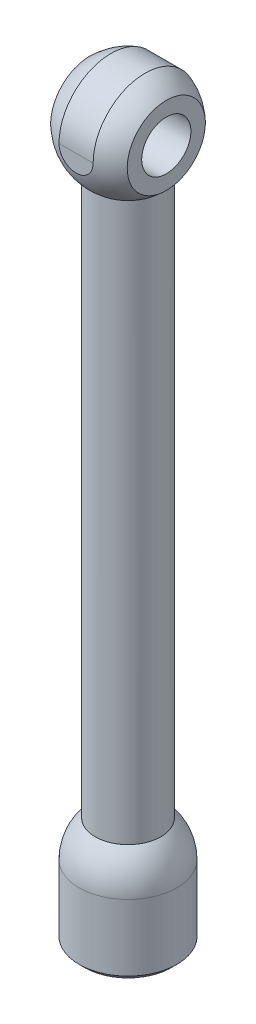
ISO-10303-21;
HEADER;
FILE_DESCRIPTION(('STEP AP214'),'2;1');
FILE_NAME('part.step','',(''),(''),'','','');
FILE_SCHEMA(('AUTOMOTIVE_DESIGN { 1 0 10303 214 1 1 1 1 }'));
ENDSEC;
DATA;
#1=APPLICATION_CONTEXT('core data for automotive mechanical design processes');
#2=APPLICATION_PROTOCOL_DEFINITION('international standard','automotive_design',2000,#1);
#3=PRODUCT_CONTEXT('',#1,'mechanical');
#4=PRODUCT('Part','Part','',(#3));
#5=PRODUCT_RELATED_PRODUCT_CATEGORY('part','',(#4));
#6=PRODUCT_DEFINITION_FORMATION('','',#4);
#7=PRODUCT_DEFINITION_CONTEXT('part definition',#1,'design');
#8=PRODUCT_DEFINITION('design','',#6,#7);
#9=PRODUCT_DEFINITION_SHAPE('','',#8);
#10=(LENGTH_UNIT() NAMED_UNIT(*) SI_UNIT(.MILLI.,.METRE.));
#11=(NAMED_UNIT(*) PLANE_ANGLE_UNIT() SI_UNIT($,.RADIAN.));
#12=(NAMED_UNIT(*) SI_UNIT($,.STERADIAN.) SOLID_ANGLE_UNIT());
#13=UNCERTAINTY_MEASURE_WITH_UNIT(LENGTH_MEASURE(1.E-05),#10,'distance_accuracy_value','');
#14=(GEOMETRIC_REPRESENTATION_CONTEXT(3) GLOBAL_UNCERTAINTY_ASSIGNED_CONTEXT((#13)) GLOBAL_UNIT_ASSIGNED_CONTEXT((#10,
#11,#12)) REPRESENTATION_CONTEXT('',''));
#15=CARTESIAN_POINT('',(0.,0.,0.));
#16=DIRECTION('',(0.,0.,1.));
#17=DIRECTION('',(1.,0.,0.));
#18=AXIS2_PLACEMENT_3D('',#15,#16,#17);
#19=CARTESIAN_POINT('',(0.,-110.,0.));
#20=DIRECTION('',(0.,1.,0.));
#21=DIRECTION('',(0.,0.,1.));
#22=AXIS2_PLACEMENT_3D('',#19,#20,#21);
#23=PLANE('',#22);
#24=CARTESIAN_POINT('',(0.,-110.,0.));
#25=DIRECTION('',(0.,1.,0.));
#26=DIRECTION('',(0.,0.,1.));
#27=AXIS2_PLACEMENT_3D('',#24,#25,#26);
#28=CIRCLE('',#27,5.99999999999993);
#29=CARTESIAN_POINT('',(0.,-110.,5.99999999999993));
#30=VERTEX_POINT('',#29);
#31=EDGE_CURVE('E187',#30,#30,#28,.T.);
#32=ORIENTED_EDGE('',*,*,#31,.T.);
#33=EDGE_LOOP('',(#32));
#34=FACE_BOUND('',#33,.T.);
#35=ADVANCED_FACE('F45',(#34),#23,.T.);
#36=CARTESIAN_POINT('',(0.,-116.617750984857,0.));
#37=DIRECTION('',(0.,1.,0.));
#38=DIRECTION('',(-1.,0.,0.));
#39=AXIS2_PLACEMENT_3D('',#36,#37,#38);
#40=SPHERICAL_SURFACE('',#39,8.93278389403744);
#41=CARTESIAN_POINT('',(0.,-116.617750984857,0.));
#42=DIRECTION('',(0.,1.,0.));
#43=DIRECTION('',(0.,0.,1.));
#44=AXIS2_PLACEMENT_3D('',#41,#42,#43);
#45=CIRCLE('',#44,8.93278389403744);
#46=CARTESIAN_POINT('',(0.,-116.617750984857,8.93278389403744));
#47=VERTEX_POINT('',#46);
#48=EDGE_CURVE('E112',#47,#47,#45,.T.);
#49=ORIENTED_EDGE('',*,*,#48,.T.);
#50=EDGE_LOOP('',(#49));
#51=FACE_BOUND('',#50,.T.);
#52=ORIENTED_EDGE('',*,*,#31,.F.);
#53=EDGE_LOOP('',(#52));
#54=FACE_BOUND('',#53,.T.);
#55=ADVANCED_FACE('F208',(#51,#54),#40,.T.);
#56=CARTESIAN_POINT('',(0.,-110.,0.));
#57=DIRECTION('',(0.,1.,0.));
#58=DIRECTION('',(0.,0.,1.));
#59=AXIS2_PLACEMENT_3D('',#56,#57,#58);
#60=CYLINDRICAL_SURFACE('',#59,8.93278389403744);
#61=DIRECTION('',(0.,1.,0.));
#62=VECTOR('',#61,1.);
#63=CARTESIAN_POINT('',(-7.71651657793688,-110.,4.5));
#64=LINE('',#63,#62);
#65=CARTESIAN_POINT('',(-7.71651657793688,-124.74705533382,4.5));
#66=VERTEX_POINT('',#65);
#67=CARTESIAN_POINT('',(-7.71651657793688,-128.752400890706,4.5));
#68=VERTEX_POINT('',#67);
#69=EDGE_CURVE('E101',#66,#68,#64,.F.);
#70=ORIENTED_EDGE('',*,*,#69,.T.);
#71=CARTESIAN_POINT('',(0.,-128.752400890706,0.));
#72=DIRECTION('',(0.,-1.,0.));
#73=DIRECTION('',(0.,0.,-1.));
#74=AXIS2_PLACEMENT_3D('',#71,#72,#73);
#75=CIRCLE('',#74,8.93278389403744);
#76=CARTESIAN_POINT('',(-7.71651657793688,-128.752400890706,-4.5));
#77=VERTEX_POINT('',#76);
#78=EDGE_CURVE('E12',#68,#77,#75,.F.);
#79=ORIENTED_EDGE('',*,*,#78,.T.);
#80=DIRECTION('',(0.,1.,0.));
#81=VECTOR('',#80,1.);
#82=CARTESIAN_POINT('',(-7.71651657793688,-110.,-4.5));
#83=LINE('',#82,#81);
#84=CARTESIAN_POINT('',(-7.71651657793688,-124.74705533382,-4.5));
#85=VERTEX_POINT('',#84);
#86=EDGE_CURVE('E124',#77,#85,#83,.T.);
#87=ORIENTED_EDGE('',*,*,#86,.T.);
#88=CARTESIAN_POINT('',(-7.71651657793688,-124.74705533382,-4.5));
#89=CARTESIAN_POINT('',(-7.71648148458441,-124.62934163974,-4.50002139169564));
#90=CARTESIAN_POINT('',(-7.71920922138473,-124.511647458003,-4.49538191249904));
#91=CARTESIAN_POINT('',(-7.72992604435372,-124.27729071066,-4.47694954682138));
#92=CARTESIAN_POINT('',(-7.73791184101997,-124.160627546253,-4.46316238319492));
#93=CARTESIAN_POINT('',(-7.75882019135261,-123.929848084622,-4.42670876454432));
#94=CARTESIAN_POINT('',(-7.77171380436301,-123.815720930911,-4.40409434298652));
#95=CARTESIAN_POINT('',(-7.80196055423327,-123.590131942456,-4.35028623981661));
#96=CARTESIAN_POINT('',(-7.8193142146088,-123.478670422281,-4.31909155103154));
#97=CARTESIAN_POINT('',(-7.87714055924617,-123.149851300292,-4.21328612874883));
#98=CARTESIAN_POINT('',(-7.92344856967786,-122.93735023567,-4.12633959385483));
#99=CARTESIAN_POINT('',(-8.02631514591867,-122.529794960636,-3.92248327705004));
#100=CARTESIAN_POINT('',(-8.08288980700447,-122.334768873643,-3.80552632618143));
#101=CARTESIAN_POINT('',(-8.2056119892703,-121.950024242758,-3.53364001496265));
#102=CARTESIAN_POINT('',(-8.27216433247432,-121.762093506634,-3.37636281785361));
#103=CARTESIAN_POINT('',(-8.40409696069733,-121.413854583979,-3.03306942083345));
#104=CARTESIAN_POINT('',(-8.46947691977481,-121.253553975573,-2.84704536295975));
#105=CARTESIAN_POINT('',(-8.5640678533697,-121.031750751577,-2.54239824040522));
#106=CARTESIAN_POINT('',(-8.59596139894984,-120.958966486761,-2.43265344393515));
#107=CARTESIAN_POINT('',(-8.65674343891858,-120.822990666671,-2.20660168902057));
#108=CARTESIAN_POINT('',(-8.68563312471219,-120.759795303599,-2.09029736069746));
#109=CARTESIAN_POINT('',(-8.73957218506538,-120.643625178834,-1.85187619331278));
#110=CARTESIAN_POINT('',(-8.7646225424196,-120.590647800632,-1.72976085228336));
#111=CARTESIAN_POINT('',(-8.81014151531057,-120.495501205936,-1.4805632291025));
#112=CARTESIAN_POINT('',(-8.83061062647131,-120.453330820211,-1.35348148599226));
#113=CARTESIAN_POINT('',(-8.86503972481586,-120.382977906547,-1.10468011841556));
#114=CARTESIAN_POINT('',(-8.87936231228362,-120.354006741381,-0.983233413837728));
#115=CARTESIAN_POINT('',(-8.90310764967808,-120.306207529012,-0.73789250936364));
#116=CARTESIAN_POINT('',(-8.91253088501938,-120.287378476948,-0.613998553197462));
#117=CARTESIAN_POINT('',(-8.9262015355395,-120.260120431229,-0.364846700502499));
#118=CARTESIAN_POINT('',(-8.93045140733797,-120.251686501328,-0.239589479865255));
#119=CARTESIAN_POINT('',(-8.93365719614512,-120.24532108773,0.0112559656988013));
#120=CARTESIAN_POINT('',(-8.93261344344934,-120.247388948773,0.136844169485232));
#121=CARTESIAN_POINT('',(-8.92559100844603,-120.261347231178,0.376154776428594));
#122=CARTESIAN_POINT('',(-8.92005745723589,-120.272351732289,0.489943229521901));
#123=CARTESIAN_POINT('',(-8.90475531924136,-120.302934005684,0.716108956630355));
#124=CARTESIAN_POINT('',(-8.89498539712806,-120.322514481184,0.828485774187991));
#125=CARTESIAN_POINT('',(-8.87144580035836,-120.370030126844,1.05099152130507));
#126=CARTESIAN_POINT('',(-8.85767754067973,-120.397962341498,1.16112123136584));
#127=CARTESIAN_POINT('',(-8.82646410037359,-120.461893686399,1.37849425748619));
#128=CARTESIAN_POINT('',(-8.80901751122325,-120.497895907184,1.48573645005318));
#129=CARTESIAN_POINT('',(-8.75121546963237,-120.618588299403,1.80495704439684));
#130=CARTESIAN_POINT('',(-8.70571167465526,-120.715352106389,2.0115881184797));
#131=CARTESIAN_POINT('',(-8.60506056587032,-120.937564574719,2.40606702370569));
#132=CARTESIAN_POINT('',(-8.54990968130288,-121.063023862673,2.59390785924891));
#133=CARTESIAN_POINT('',(-8.4289065437931,-121.352821628363,2.9647450055318));
#134=CARTESIAN_POINT('',(-8.36253530114493,-121.519728749244,3.14556578013506));
#135=CARTESIAN_POINT('',(-8.22987252265295,-121.880985090627,3.47791631653475));
#136=CARTESIAN_POINT('',(-8.16358111596308,-122.075359369112,3.62941902938453));
#137=CARTESIAN_POINT('',(-8.06739890835108,-122.391367765796,3.8364085613677));
#138=CARTESIAN_POINT('',(-8.03495188459116,-122.504642791429,3.90371968519037));
#139=CARTESIAN_POINT('',(-7.97315285074131,-122.737303152918,4.02843608612254));
#140=CARTESIAN_POINT('',(-7.94379948216436,-122.856685772309,4.08584571828684));
#141=CARTESIAN_POINT('',(-7.88930878866345,-123.100645962726,4.1900950050093));
#142=CARTESIAN_POINT('',(-7.86416376235475,-123.225213511533,4.23695402300319));
#143=CARTESIAN_POINT('',(-7.81904912381102,-123.478797869829,4.31964261153951));
#144=CARTESIAN_POINT('',(-7.79907727479617,-123.607812728957,4.3554769501984));
#145=CARTESIAN_POINT('',(-7.76086423474424,-123.902784737641,4.42329445694898));
#146=CARTESIAN_POINT('',(-7.74436712306624,-124.069763061552,4.45195785045429));
#147=CARTESIAN_POINT('',(-7.72773047351135,-124.322423955871,4.48072723691847));
#148=CARTESIAN_POINT('',(-7.72353629190816,-124.407104876786,4.48794616418604));
#149=CARTESIAN_POINT('',(-7.71792590682583,-124.576866156951,4.49758429057258));
#150=CARTESIAN_POINT('',(-7.71651086206458,-124.661946667989,4.50000148768965));
#151=CARTESIAN_POINT('',(-7.71651657793688,-124.74705533382,4.5));
#152=B_SPLINE_CURVE_WITH_KNOTS('',3,(#88,#89,#90,#91,#92,#93,#94,#95,#96,#97,#98,#99,#100,#101,
#102,#103,#104,#105,#106,#107,#108,#109,#110,#111,#112,#113,#114,#115,#116,#117,#118,#119,#120,
#121,#122,#123,#124,#125,#126,#127,#128,#129,#130,#131,#132,#133,#134,#135,#136,#137,#138,#139,
#140,#141,#142,#143,#144,#145,#146,#147,#148,#149,#150,#151),.UNSPECIFIED.,.F.,.F.,(4,2,2,2,2,2,
2,2,2,2,2,2,2,2,2,2,2,2,2,2,2,2,2,2,2,2,2,2,2,2,2,4),(0.,0.352986131275732,0.705751639946816,
1.0564683856131,1.40722631685948,2.10660502931816,2.80708979857007,3.56578442206685,
4.32468680300397,4.73072345067371,5.13659843488338,5.54236934870849,5.94809634280057,
6.32460470108411,6.70107574882384,7.07736795597132,7.45363668466587,7.7965898373916,
8.13965116963131,8.48259124301529,8.82566287587469,9.52047414968345,10.2155431462219,
10.9769866000108,11.7391292494854,12.1457870271982,12.5522654825785,12.9579917384768,
13.3635422724,13.8726473796493,14.12776595188,14.38299086927),.UNSPECIFIED.);
#153=EDGE_CURVE('E119',#85,#66,#152,.T.);
#154=ORIENTED_EDGE('',*,*,#153,.T.);
#155=EDGE_LOOP('',(#70,#79,#87,#154));
#156=FACE_BOUND('',#155,.T.);
#157=ORIENTED_EDGE('',*,*,#48,.F.);
#158=EDGE_LOOP('',(#157));
#159=FACE_BOUND('',#158,.T.);
#160=ADVANCED_FACE('F126',(#156,#159),#60,.T.);
#161=CARTESIAN_POINT('',(0.,-129.752400890706,0.));
#162=DIRECTION('',(0.,-1.,0.));
#163=DIRECTION('',(0.,0.,-1.));
#164=AXIS2_PLACEMENT_3D('',#161,#162,#163);
#165=PLANE('',#164);
#166=DIRECTION('',(1.,0.,0.));
#167=VECTOR('',#166,1.);
#168=CARTESIAN_POINT('',(-8.93378389403744,-129.752400890706,4.5));
#169=LINE('',#168,#167);
#170=CARTESIAN_POINT('',(-6.53292126919495,-129.752400890706,4.5));
#171=VERTEX_POINT('',#170);
#172=CARTESIAN_POINT('',(-3.98341815305991,-129.752400890706,4.5));
#173=VERTEX_POINT('',#172);
#174=EDGE_CURVE('E123',#171,#173,#169,.T.);
#175=ORIENTED_EDGE('',*,*,#174,.T.);
#176=CARTESIAN_POINT('',(0.,-129.752400890706,0.));
#177=DIRECTION('',(0.,-1.,0.));
#178=DIRECTION('',(0.,0.,-1.));
#179=AXIS2_PLACEMENT_3D('',#176,#177,#178);
#180=CIRCLE('',#179,6.00979368881555);
#181=CARTESIAN_POINT('',(-3.98341815305991,-129.752400890706,-4.5));
#182=VERTEX_POINT('',#181);
#183=EDGE_CURVE('E68',#173,#182,#180,.F.);
#184=ORIENTED_EDGE('',*,*,#183,.T.);
#185=DIRECTION('',(1.,0.,0.));
#186=VECTOR('',#185,1.);
#187=CARTESIAN_POINT('',(-8.93378389403744,-129.752400890706,-4.5));
#188=LINE('',#187,#186);
#189=CARTESIAN_POINT('',(-6.53292126919495,-129.752400890706,-4.5));
#190=VERTEX_POINT('',#189);
#191=EDGE_CURVE('E180',#190,#182,#188,.T.);
#192=ORIENTED_EDGE('',*,*,#191,.F.);
#193=CARTESIAN_POINT('',(0.,-129.752400890706,0.));
#194=DIRECTION('',(0.,-1.,0.));
#195=DIRECTION('',(0.,0.,-1.));
#196=AXIS2_PLACEMENT_3D('',#193,#194,#195);
#197=CIRCLE('',#196,7.93278389403743);
#198=EDGE_CURVE('E175',#190,#171,#197,.T.);
#199=ORIENTED_EDGE('',*,*,#198,.T.);
#200=EDGE_LOOP('',(#175,#184,#192,#199));
#201=FACE_BOUND('',#200,.T.);
#202=ADVANCED_FACE('F182',(#201),#165,.T.);
#203=CARTESIAN_POINT('',(0.,-124.863437074568,0.));
#204=DIRECTION('',(0.,-1.,0.));
#205=DIRECTION('',(0.,0.,1.));
#206=AXIS2_PLACEMENT_3D('',#203,#204,#205);
#207=SPHERICAL_SURFACE('',#206,7.00000000000001);
#208=CARTESIAN_POINT('',(0.,-124.863437074568,-4.5));
#209=DIRECTION('',(0.,0.,-1.));
#210=DIRECTION('',(0.,1.,0.));
#211=AXIS2_PLACEMENT_3D('',#208,#209,#210);
#212=CIRCLE('',#211,5.36190264738181);
#213=CARTESIAN_POINT('',(-3.1244441771975,-129.220941932118,-4.5));
#214=VERTEX_POINT('',#213);
#215=CARTESIAN_POINT('',(-5.36063944790364,-124.74705533382,-4.5));
#216=VERTEX_POINT('',#215);
#217=EDGE_CURVE('E129',#214,#216,#212,.T.);
#218=ORIENTED_EDGE('',*,*,#217,.F.);
#219=CARTESIAN_POINT('',(0.,-129.220941932118,0.));
#220=DIRECTION('',(0.,1.,0.));
#221=DIRECTION('',(0.,0.,1.));
#222=AXIS2_PLACEMENT_3D('',#219,#220,#221);
#223=CIRCLE('',#222,5.4783347302282);
#224=CARTESIAN_POINT('',(-3.12444417719767,-129.220941932118,4.5));
#225=VERTEX_POINT('',#224);
#226=EDGE_CURVE('E185',#214,#225,#223,.F.);
#227=ORIENTED_EDGE('',*,*,#226,.T.);
#228=CARTESIAN_POINT('',(0.,-124.863437074568,4.5));
#229=DIRECTION('',(0.,0.,1.));
#230=DIRECTION('',(0.,-1.,0.));
#231=AXIS2_PLACEMENT_3D('',#228,#229,#230);
#232=CIRCLE('',#231,5.36190264738181);
#233=CARTESIAN_POINT('',(-5.36063944790364,-124.74705533382,4.5));
#234=VERTEX_POINT('',#233);
#235=EDGE_CURVE('E113',#234,#225,#232,.T.);
#236=ORIENTED_EDGE('',*,*,#235,.F.);
#237=CARTESIAN_POINT('',(-5.36064378998614,-124.74725533382,-4.49999999555556));
#238=CARTESIAN_POINT('',(-5.35789557254402,-124.620669040771,-4.50001921414418));
#239=CARTESIAN_POINT('',(-5.35514523702304,-124.494084503417,-4.49467045469406));
#240=CARTESIAN_POINT('',(-5.34966003951603,-124.241820514155,-4.4733351315755));
#241=CARTESIAN_POINT('',(-5.34692517680203,-124.11614101959,-4.45734907263598));
#242=CARTESIAN_POINT('',(-5.34149226173711,-123.866663371228,-4.41485208227213));
#243=CARTESIAN_POINT('',(-5.33879418508709,-123.742863968697,-4.3883484851452));
#244=CARTESIAN_POINT('',(-5.33345230121074,-123.497937687846,-4.32500899062546));
#245=CARTESIAN_POINT('',(-5.33080849332109,-123.376810776858,-4.28817321960229));
#246=CARTESIAN_POINT('',(-5.32559342976875,-123.138054163865,-4.20441736868904));
#247=CARTESIAN_POINT('',(-5.32302219526273,-123.020425481142,-4.15749438182119));
#248=CARTESIAN_POINT('',(-5.31797077977244,-122.789495430664,-4.05388466466387));
#249=CARTESIAN_POINT('',(-5.31549063278053,-122.676195677772,-3.99719433338867));
#250=CARTESIAN_POINT('',(-5.3106418468329,-122.454838629385,-3.87449955532795));
#251=CARTESIAN_POINT('',(-5.30827314541191,-122.346778396074,-3.80850041111117));
#252=CARTESIAN_POINT('',(-5.30366221316769,-122.136561051755,-3.66760631531108));
#253=CARTESIAN_POINT('',(-5.30142002933803,-122.034406133871,-3.59270808992683));
#254=CARTESIAN_POINT('',(-5.29708052583192,-121.836814020759,-3.43460308020641));
#255=CARTESIAN_POINT('',(-5.29498314169885,-121.741373836146,-3.35140003357648));
#256=CARTESIAN_POINT('',(-5.29094684498964,-121.557805690931,-3.17721606524854));
#257=CARTESIAN_POINT('',(-5.28900799122243,-121.469680443719,-3.0862322825607));
#258=CARTESIAN_POINT('',(-5.28530437462339,-121.301427247652,-2.89718070517585));
#259=CARTESIAN_POINT('',(-5.28353957405523,-121.221297565241,-2.79911445404571));
#260=CARTESIAN_POINT('',(-5.28019606992001,-121.069555990193,-2.5965399990878));
#261=CARTESIAN_POINT('',(-5.27861743530639,-120.997947253515,-2.49202943005885));
#262=CARTESIAN_POINT('',(-5.27565973302168,-120.863835110361,-2.277411278265));
#263=CARTESIAN_POINT('',(-5.27428053834661,-120.8013259091,-2.16730731830075));
#264=CARTESIAN_POINT('',(-5.27173033657038,-120.685781759042,-1.94218206220167));
#265=CARTESIAN_POINT('',(-5.27055940649925,-120.63275031571,-1.82715896607618));
#266=CARTESIAN_POINT('',(-5.26843559301157,-120.53658892069,-1.59310134882435));
#267=CARTESIAN_POINT('',(-5.26748261526626,-120.493454685508,-1.47406858875079));
#268=CARTESIAN_POINT('',(-5.2658008749629,-120.417350620606,-1.23275040702563));
#269=CARTESIAN_POINT('',(-5.26507219503602,-120.384384536816,-1.11046380464199));
#270=CARTESIAN_POINT('',(-5.26384539961057,-120.328891137792,-0.863602264125843));
#271=CARTESIAN_POINT('',(-5.26334715645701,-120.30635804299,-0.739028632802648));
#272=CARTESIAN_POINT('',(-5.26258403408961,-120.271848574027,-0.48843011895206));
#273=CARTESIAN_POINT('',(-5.26231923607914,-120.259875873274,-0.36240474687038));
#274=CARTESIAN_POINT('',(-5.26187983156348,-120.240007579437,0.0165194931722907));
#275=CARTESIAN_POINT('',(-5.26205892566189,-120.248103519074,0.270526489642968));
#276=CARTESIAN_POINT('',(-5.26303098380243,-120.292060095259,0.647403226155348));
#277=CARTESIAN_POINT('',(-5.26347261393976,-120.312031338801,0.772397837751783));
#278=CARTESIAN_POINT('',(-5.2645866932939,-120.362421794686,1.02026526708328));
#279=CARTESIAN_POINT('',(-5.26525906221857,-120.392837372625,1.14313880730473));
#280=CARTESIAN_POINT('',(-5.26683001017105,-120.463919712209,1.38591696440232));
#281=CARTESIAN_POINT('',(-5.26772866931419,-120.504590104453,1.50582051324063));
#282=CARTESIAN_POINT('',(-5.269744934978,-120.595868825706,1.74173403056422));
#283=CARTESIAN_POINT('',(-5.27086246086828,-120.646473494949,1.85774541454135));
#284=CARTESIAN_POINT('',(-5.27330886250713,-120.757295335555,2.08514298896761));
#285=CARTESIAN_POINT('',(-5.27463783199084,-120.817516770173,2.19652710035119));
#286=CARTESIAN_POINT('',(-5.27749630550255,-120.947103248616,2.4137846365872));
#287=CARTESIAN_POINT('',(-5.2790257353922,-121.016464912065,2.51966007864342));
#288=CARTESIAN_POINT('',(-5.28227464503945,-121.163879407626,2.72522522127519));
#289=CARTESIAN_POINT('',(-5.28399418550857,-121.241935016196,2.82491292984562));
#290=CARTESIAN_POINT('',(-5.28760947728229,-121.40613361069,3.01732194889758));
#291=CARTESIAN_POINT('',(-5.28950516336978,-121.492273603526,3.11004581489799));
#292=CARTESIAN_POINT('',(-5.29346009421793,-121.672090878307,3.28794709116744));
#293=CARTESIAN_POINT('',(-5.29551940735427,-121.765771311431,3.37312131484185));
#294=CARTESIAN_POINT('',(-5.29978491984328,-121.959935825538,3.5352446793339));
#295=CARTESIAN_POINT('',(-5.30199106477898,-122.060417386205,3.61219684006504));
#296=CARTESIAN_POINT('',(-5.30653628800708,-122.26757239047,3.7574161041452));
#297=CARTESIAN_POINT('',(-5.30887545673297,-122.374250047436,3.82567719442294));
#298=CARTESIAN_POINT('',(-5.31366733162526,-122.592935135945,3.95294386988895));
#299=CARTESIAN_POINT('',(-5.31611999560211,-122.704940587413,4.011952859127));
#300=CARTESIAN_POINT('',(-5.32112483622071,-122.93366074942,4.1203929171046));
#301=CARTESIAN_POINT('',(-5.32367713034864,-123.050381025801,4.16981224088323));
#302=CARTESIAN_POINT('',(-5.32885891220375,-123.287527870843,4.25861527458581));
#303=CARTESIAN_POINT('',(-5.33148837056754,-123.407953030504,4.29800274810251));
#304=CARTESIAN_POINT('',(-5.33680336433916,-123.65155618391,4.36644852011198));
#305=CARTESIAN_POINT('',(-5.33948883488928,-123.774731004248,4.39551813160043));
#306=CARTESIAN_POINT('',(-5.34489836779516,-124.023041257913,4.44317159154655));
#307=CARTESIAN_POINT('',(-5.34762241055118,-124.148175698695,4.4617605824563));
#308=CARTESIAN_POINT('',(-5.35206750355206,-124.35252754255,4.48337051437796));
#309=CARTESIAN_POINT('',(-5.35378272514306,-124.431418316029,4.48961362302611));
#310=CARTESIAN_POINT('',(-5.35721344350307,-124.589288462428,4.49792712909222));
#311=CARTESIAN_POINT('',(-5.35892893512359,-124.668267472923,4.50000441178848));
#312=CARTESIAN_POINT('',(-5.36064378998614,-124.74725533382,4.49999999555556));
#313=B_SPLINE_CURVE_WITH_KNOTS('',3,(#237,#238,#239,#240,#241,#242,#243,#244,#245,#246,#247,
#248,#249,#250,#251,#252,#253,#254,#255,#256,#257,#258,#259,#260,#261,#262,#263,#264,#265,#266,
#267,#268,#269,#270,#271,#272,#273,#274,#275,#276,#277,#278,#279,#280,#281,#282,#283,#284,#285,
#286,#287,#288,#289,#290,#291,#292,#293,#294,#295,#296,#297,#298,#299,#300,#301,#302,#303,#304,
#305,#306,#307,#308,#309,#310,#311,#312),.UNSPECIFIED.,.F.,.F.,(4,2,2,2,2,2,2,2,2,2,2,2,2,2,2,2,
2,2,2,2,2,2,2,2,2,2,2,2,2,2,2,2,2,2,2,2,2,4),(0.,0.379732457501794,0.759446898374259,
1.13889701327351,1.51834248743767,1.89789745879229,2.27759266357387,2.65707245000288,
3.03669227453305,3.41614200946401,3.79573187360895,4.1752392574123,4.55488676722974,
4.93429144147399,5.3138361541308,5.69321628941196,6.07273602129808,6.45204525819319,
6.83148638497063,7.58957884919336,7.96898323804571,8.34825573597238,8.72766270001741,
9.10693015276056,9.48636620957604,9.86566232951207,10.2450799289058,10.6243576062366,
11.003794616343,11.3830917789727,11.762649955304,12.1420681545417,12.5219481538938,
12.9016854251805,13.281005038782,13.6601383719733,13.8975052899486,14.1344795634067),.UNSPECIFIED.);
#314=EDGE_CURVE('E122',#216,#234,#313,.T.);
#315=ORIENTED_EDGE('',*,*,#314,.F.);
#316=EDGE_LOOP('',(#218,#227,#236,#315));
#317=FACE_BOUND('',#316,.T.);
#318=ADVANCED_FACE('F197',(#317),#207,.F.);
#319=CARTESIAN_POINT('',(-8.93378389403744,-124.74705533382,0.));
#320=DIRECTION('',(1.,0.,0.));
#321=DIRECTION('',(0.,0.,-1.));
#322=AXIS2_PLACEMENT_3D('',#319,#320,#321);
#323=CYLINDRICAL_SURFACE('',#322,4.5);
#324=DIRECTION('',(1.,0.,0.));
#325=VECTOR('',#324,1.);
#326=CARTESIAN_POINT('',(-8.93378389403744,-124.74705533382,-4.5));
#327=LINE('',#326,#325);
#328=EDGE_CURVE('E183',#85,#216,#327,.T.);
#329=ORIENTED_EDGE('',*,*,#328,.T.);
#330=ORIENTED_EDGE('',*,*,#314,.T.);
#331=DIRECTION('',(1.,0.,0.));
#332=VECTOR('',#331,1.);
#333=CARTESIAN_POINT('',(-8.93378389403744,-124.74705533382,4.5));
#334=LINE('',#333,#332);
#335=EDGE_CURVE('E105',#66,#234,#334,.T.);
#336=ORIENTED_EDGE('',*,*,#335,.F.);
#337=ORIENTED_EDGE('',*,*,#153,.F.);
#338=EDGE_LOOP('',(#329,#330,#336,#337));
#339=FACE_BOUND('',#338,.T.);
#340=ADVANCED_FACE('F118',(#339),#323,.F.);
#341=CARTESIAN_POINT('',(-8.93378389403744,-129.752400890706,-4.5));
#342=DIRECTION('',(0.,0.,-1.));
#343=DIRECTION('',(0.,1.,0.));
#344=AXIS2_PLACEMENT_3D('',#341,#342,#343);
#345=PLANE('',#344);
#346=ORIENTED_EDGE('',*,*,#191,.T.);
#347=CARTESIAN_POINT('',(-3.98341815305991,-129.752400890706,-4.5));
#348=CARTESIAN_POINT('',(-3.9132349091599,-129.705884769155,-4.5));
#349=CARTESIAN_POINT('',(-3.84273525749811,-129.659842610376,-4.5));
#350=CARTESIAN_POINT('',(-3.70107047667817,-129.568838271854,-4.5));
#351=CARTESIAN_POINT('',(-3.62990553858009,-129.523875794523,-4.5));
#352=CARTESIAN_POINT('',(-3.48683559151654,-129.435135030352,-4.5));
#353=CARTESIAN_POINT('',(-3.41493055321287,-129.391356790707,-4.5));
#354=CARTESIAN_POINT('',(-3.27030688838069,-129.305119791056,-4.5));
#355=CARTESIAN_POINT('',(-3.19758804041234,-129.262661402672,-4.5));
#356=CARTESIAN_POINT('',(-3.12444417719763,-129.220941932118,-4.5));
#357=B_SPLINE_CURVE_WITH_KNOTS('',3,(#347,#348,#349,#350,#351,#352,#353,#354,#355,#356),
.UNSPECIFIED.,.F.,.F.,(4,2,2,2,4),(0.,0.252597178762452,0.505123917290255,0.757660705041761,
1.01026796553806),.UNSPECIFIED.);
#358=EDGE_CURVE('E54',#182,#214,#357,.T.);
#359=ORIENTED_EDGE('',*,*,#358,.T.);
#360=ORIENTED_EDGE('',*,*,#217,.T.);
#361=ORIENTED_EDGE('',*,*,#328,.F.);
#362=ORIENTED_EDGE('',*,*,#86,.F.);
#363=CARTESIAN_POINT('',(-7.71651657793688,-128.752400890706,-4.5));
#364=CARTESIAN_POINT('',(-7.61879842379684,-128.836812052602,-4.5));
#365=CARTESIAN_POINT('',(-7.52088058485892,-128.920992602901,-4.5));
#366=CARTESIAN_POINT('',(-7.32460595730327,-129.088833465064,-4.5));
#367=CARTESIAN_POINT('',(-7.22624918389334,-129.172493794714,-4.5));
#368=CARTESIAN_POINT('',(-7.02904981644551,-129.339241500637,-4.5));
#369=CARTESIAN_POINT('',(-6.93020721956679,-129.422328873553,-4.5));
#370=CARTESIAN_POINT('',(-6.73198164105922,-129.587863299071,-4.5));
#371=CARTESIAN_POINT('',(-6.63259864095659,-129.670310329547,-4.5));
#372=CARTESIAN_POINT('',(-6.53292126919497,-129.752400890706,-4.5));
#373=B_SPLINE_CURVE_WITH_KNOTS('',3,(#363,#364,#365,#366,#367,#368,#369,#370,#371,#372),
.UNSPECIFIED.,.F.,.F.,(4,2,2,2,4),(0.,0.387384638558541,0.774755957985067,1.16212954524759,
1.54951645925399),.UNSPECIFIED.);
#374=EDGE_CURVE('E61',#77,#190,#373,.T.);
#375=ORIENTED_EDGE('',*,*,#374,.T.);
#376=EDGE_LOOP('',(#346,#359,#360,#361,#362,#375));
#377=FACE_BOUND('',#376,.T.);
#378=ADVANCED_FACE('F147',(#377),#345,.F.);
#379=CARTESIAN_POINT('',(-8.93378389403744,-124.74705533382,4.5));
#380=DIRECTION('',(0.,0.,1.));
#381=DIRECTION('',(0.,-1.,0.));
#382=AXIS2_PLACEMENT_3D('',#379,#380,#381);
#383=PLANE('',#382);
#384=ORIENTED_EDGE('',*,*,#235,.T.);
#385=CARTESIAN_POINT('',(-3.12444417719768,-129.220941932118,4.5));
#386=CARTESIAN_POINT('',(-3.19758804041239,-129.262661402672,4.5));
#387=CARTESIAN_POINT('',(-3.27030688838073,-129.305119791056,4.5));
#388=CARTESIAN_POINT('',(-3.41493055321289,-129.391356790707,4.5));
#389=CARTESIAN_POINT('',(-3.48683559151655,-129.435135030352,4.5));
#390=CARTESIAN_POINT('',(-3.6299055385801,-129.523875794523,4.5));
#391=CARTESIAN_POINT('',(-3.70107047667818,-129.568838271854,4.5));
#392=CARTESIAN_POINT('',(-3.84273525749812,-129.659842610376,4.5));
#393=CARTESIAN_POINT('',(-3.91323490915991,-129.705884769155,4.5));
#394=CARTESIAN_POINT('',(-3.98341815305991,-129.752400890706,4.5));
#395=B_SPLINE_CURVE_WITH_KNOTS('',3,(#385,#386,#387,#388,#389,#390,#391,#392,#393,#394),
.UNSPECIFIED.,.F.,.F.,(4,2,2,2,4),(0.,0.252607260496258,0.50514404824777,0.757670786775549,
1.010267965538),.UNSPECIFIED.);
#396=EDGE_CURVE('E169',#225,#173,#395,.T.);
#397=ORIENTED_EDGE('',*,*,#396,.T.);
#398=ORIENTED_EDGE('',*,*,#174,.F.);
#399=CARTESIAN_POINT('',(-6.53292126919495,-129.752400890706,4.5));
#400=CARTESIAN_POINT('',(-6.63259864095658,-129.670310329547,4.5));
#401=CARTESIAN_POINT('',(-6.73198164105921,-129.587863299071,4.5));
#402=CARTESIAN_POINT('',(-6.93020721956679,-129.422328873553,4.5));
#403=CARTESIAN_POINT('',(-7.02904981644551,-129.339241500637,4.5));
#404=CARTESIAN_POINT('',(-7.22624918389333,-129.172493794714,4.5));
#405=CARTESIAN_POINT('',(-7.32460595730327,-129.088833465064,4.5));
#406=CARTESIAN_POINT('',(-7.52088058485893,-128.920992602901,4.5));
#407=CARTESIAN_POINT('',(-7.61879842379685,-128.836812052602,4.5));
#408=CARTESIAN_POINT('',(-7.71651657793689,-128.752400890706,4.5));
#409=B_SPLINE_CURVE_WITH_KNOTS('',3,(#399,#400,#401,#402,#403,#404,#405,#406,#407,#408),
.UNSPECIFIED.,.F.,.F.,(4,2,2,2,4),(0.,0.387386914006394,0.774760501268941,1.16213182069547,
1.54951645925402),.UNSPECIFIED.);
#410=EDGE_CURVE('E109',#171,#68,#409,.T.);
#411=ORIENTED_EDGE('',*,*,#410,.T.);
#412=ORIENTED_EDGE('',*,*,#69,.F.);
#413=ORIENTED_EDGE('',*,*,#335,.T.);
#414=EDGE_LOOP('',(#384,#397,#398,#411,#412,#413));
#415=FACE_BOUND('',#414,.T.);
#416=ADVANCED_FACE('F104',(#415),#383,.F.);
#417=CARTESIAN_POINT('',(0.,-129.220941932118,0.));
#418=DIRECTION('',(0.,-1.,0.));
#419=DIRECTION('',(0.,0.,-1.));
#420=AXIS2_PLACEMENT_3D('',#417,#418,#419);
#421=CONICAL_SURFACE('',#420,5.4783347302282,0.785398163397465);
#422=ORIENTED_EDGE('',*,*,#358,.F.);
#423=ORIENTED_EDGE('',*,*,#183,.F.);
#424=ORIENTED_EDGE('',*,*,#396,.F.);
#425=ORIENTED_EDGE('',*,*,#226,.F.);
#426=EDGE_LOOP('',(#422,#423,#424,#425));
#427=FACE_BOUND('',#426,.T.);
#428=ADVANCED_FACE('F161',(#427),#421,.F.);
#429=CARTESIAN_POINT('',(0.,-128.752400890706,0.));
#430=DIRECTION('',(0.,1.,0.));
#431=DIRECTION('',(0.,0.,1.));
#432=AXIS2_PLACEMENT_3D('',#429,#430,#431);
#433=CONICAL_SURFACE('',#432,8.93278389403744,0.785398163397438);
#434=ORIENTED_EDGE('',*,*,#410,.F.);
#435=ORIENTED_EDGE('',*,*,#198,.F.);
#436=ORIENTED_EDGE('',*,*,#374,.F.);
#437=ORIENTED_EDGE('',*,*,#78,.F.);
#438=EDGE_LOOP('',(#434,#435,#436,#437));
#439=FACE_BOUND('',#438,.T.);
#440=ADVANCED_FACE('F47',(#439),#433,.T.);
#441=CLOSED_SHELL('',(#35,#55,#160,#202,#318,#340,#378,#416,#428,#440));
#442=MANIFOLD_SOLID_BREP('B2',#441);
#443=CARTESIAN_POINT('',(0.,0.,0.));
#444=DIRECTION('',(0.,1.,0.));
#445=DIRECTION('',(1.,0.,0.));
#446=AXIS2_PLACEMENT_3D('',#443,#444,#445);
#447=SPHERICAL_SURFACE('',#446,10.);
#448=CARTESIAN_POINT('',(0.,-8.,0.));
#449=DIRECTION('',(0.,1.,0.));
#450=DIRECTION('',(0.,0.,1.));
#451=AXIS2_PLACEMENT_3D('',#448,#449,#450);
#452=CIRCLE('',#451,6.);
#453=CARTESIAN_POINT('',(0.,-8.,6.));
#454=VERTEX_POINT('',#453);
#455=EDGE_CURVE('E321',#454,#454,#452,.T.);
#456=ORIENTED_EDGE('',*,*,#455,.T.);
#457=EDGE_LOOP('',(#456));
#458=FACE_BOUND('',#457,.T.);
#459=CARTESIAN_POINT('',(-3.1224989991992,0.,0.));
#460=DIRECTION('',(1.,0.,0.));
#461=DIRECTION('',(0.,0.,-1.));
#462=AXIS2_PLACEMENT_3D('',#459,#460,#461);
#463=CIRCLE('',#462,9.5);
#464=CARTESIAN_POINT('',(-3.12249899919921,0.,9.5));
#465=VERTEX_POINT('',#464);
#466=CARTESIAN_POINT('',(-3.12249899919921,0.,-9.5));
#467=VERTEX_POINT('',#466);
#468=EDGE_CURVE('E291',#465,#467,#463,.F.);
#469=ORIENTED_EDGE('',*,*,#468,.T.);
#470=CARTESIAN_POINT('',(0.,0.,-9.5));
#471=DIRECTION('',(0.,0.,1.));
#472=DIRECTION('',(1.,0.,0.));
#473=AXIS2_PLACEMENT_3D('',#470,#471,#472);
#474=CIRCLE('',#473,3.12249899919921);
#475=CARTESIAN_POINT('',(3.12249899919921,0.,-9.5));
#476=VERTEX_POINT('',#475);
#477=EDGE_CURVE('E43',#467,#476,#474,.T.);
#478=ORIENTED_EDGE('',*,*,#477,.T.);
#479=CARTESIAN_POINT('',(3.1224989991992,0.,0.));
#480=DIRECTION('',(-1.,0.,0.));
#481=DIRECTION('',(0.,0.,1.));
#482=AXIS2_PLACEMENT_3D('',#479,#480,#481);
#483=CIRCLE('',#482,9.5);
#484=CARTESIAN_POINT('',(3.12249899919921,0.,9.5));
#485=VERTEX_POINT('',#484);
#486=EDGE_CURVE('E315',#476,#485,#483,.F.);
#487=ORIENTED_EDGE('',*,*,#486,.T.);
#488=CARTESIAN_POINT('',(0.,0.,9.5));
#489=DIRECTION('',(0.,0.,-1.));
#490=DIRECTION('',(-1.,0.,0.));
#491=AXIS2_PLACEMENT_3D('',#488,#489,#490);
#492=CIRCLE('',#491,3.12249899919921);
#493=EDGE_CURVE('E310',#485,#465,#492,.T.);
#494=ORIENTED_EDGE('',*,*,#493,.T.);
#495=EDGE_LOOP('',(#469,#478,#487,#494));
#496=FACE_BOUND('',#495,.T.);
#497=CARTESIAN_POINT('',(7.,0.,0.));
#498=DIRECTION('',(-1.,0.,0.));
#499=DIRECTION('',(0.,0.,1.));
#500=AXIS2_PLACEMENT_3D('',#497,#498,#499);
#501=CIRCLE('',#500,7.14142842854285);
#502=CARTESIAN_POINT('',(7.,0.,7.14142842854285));
#503=VERTEX_POINT('',#502);
#504=EDGE_CURVE('E316',#503,#503,#501,.T.);
#505=ORIENTED_EDGE('',*,*,#504,.T.);
#506=EDGE_LOOP('',(#505));
#507=FACE_BOUND('',#506,.T.);
#508=CARTESIAN_POINT('',(-7.,0.,0.));
#509=DIRECTION('',(1.,0.,0.));
#510=DIRECTION('',(0.,0.,-1.));
#511=AXIS2_PLACEMENT_3D('',#508,#509,#510);
#512=CIRCLE('',#511,7.14142842854285);
#513=CARTESIAN_POINT('',(-7.,0.,-7.14142842854285));
#514=VERTEX_POINT('',#513);
#515=EDGE_CURVE('E339',#514,#514,#512,.T.);
#516=ORIENTED_EDGE('',*,*,#515,.T.);
#517=EDGE_LOOP('',(#516));
#518=FACE_BOUND('',#517,.T.);
#519=ADVANCED_FACE('F283',(#458,#496,#507,#518),#447,.T.);
#520=CARTESIAN_POINT('',(-7.,-10.,-7.14142842854285));
#521=DIRECTION('',(1.,0.,0.));
#522=DIRECTION('',(0.,0.,-1.));
#523=AXIS2_PLACEMENT_3D('',#520,#521,#522);
#524=PLANE('',#523);
#525=CARTESIAN_POINT('',(-7.,0.,0.));
#526=DIRECTION('',(-1.,0.,0.));
#527=DIRECTION('',(0.,0.,1.));
#528=AXIS2_PLACEMENT_3D('',#525,#526,#527);
#529=CIRCLE('',#528,4.5);
#530=CARTESIAN_POINT('',(-7.,0.,4.5));
#531=VERTEX_POINT('',#530);
#532=EDGE_CURVE('E336',#531,#531,#529,.T.);
#533=ORIENTED_EDGE('',*,*,#532,.F.);
#534=EDGE_LOOP('',(#533));
#535=FACE_BOUND('',#534,.T.);
#536=ORIENTED_EDGE('',*,*,#515,.F.);
#537=EDGE_LOOP('',(#536));
#538=FACE_BOUND('',#537,.T.);
#539=ADVANCED_FACE('F348',(#535,#538),#524,.F.);
#540=CARTESIAN_POINT('',(7.,-10.,-7.14142842854285));
#541=DIRECTION('',(-1.,0.,0.));
#542=DIRECTION('',(0.,0.,1.));
#543=AXIS2_PLACEMENT_3D('',#540,#541,#542);
#544=PLANE('',#543);
#545=CARTESIAN_POINT('',(7.,0.,0.));
#546=DIRECTION('',(-1.,0.,0.));
#547=DIRECTION('',(0.,0.,1.));
#548=AXIS2_PLACEMENT_3D('',#545,#546,#547);
#549=CIRCLE('',#548,4.5);
#550=CARTESIAN_POINT('',(7.,0.,4.5));
#551=VERTEX_POINT('',#550);
#552=EDGE_CURVE('E286',#551,#551,#549,.T.);
#553=ORIENTED_EDGE('',*,*,#552,.T.);
#554=EDGE_LOOP('',(#553));
#555=FACE_BOUND('',#554,.T.);
#556=ORIENTED_EDGE('',*,*,#504,.F.);
#557=EDGE_LOOP('',(#556));
#558=FACE_BOUND('',#557,.T.);
#559=ADVANCED_FACE('F346',(#555,#558),#544,.F.);
#560=CARTESIAN_POINT('',(7.,0.,0.));
#561=DIRECTION('',(-1.,0.,0.));
#562=DIRECTION('',(0.,0.,1.));
#563=AXIS2_PLACEMENT_3D('',#560,#561,#562);
#564=CYLINDRICAL_SURFACE('',#563,9.5);
#565=DIRECTION('',(-1.,0.,0.));
#566=VECTOR('',#565,1.);
#567=CARTESIAN_POINT('',(7.,0.,9.5));
#568=LINE('',#567,#566);
#569=EDGE_CURVE('E298',#485,#465,#568,.T.);
#570=ORIENTED_EDGE('',*,*,#569,.F.);
#571=ORIENTED_EDGE('',*,*,#486,.F.);
#572=DIRECTION('',(-1.,0.,0.));
#573=VECTOR('',#572,1.);
#574=CARTESIAN_POINT('',(7.,0.,-9.5));
#575=LINE('',#574,#573);
#576=EDGE_CURVE('E320',#476,#467,#575,.T.);
#577=ORIENTED_EDGE('',*,*,#576,.T.);
#578=ORIENTED_EDGE('',*,*,#468,.F.);
#579=EDGE_LOOP('',(#570,#571,#577,#578));
#580=FACE_BOUND('',#579,.T.);
#581=ADVANCED_FACE('F319',(#580),#564,.T.);
#582=CARTESIAN_POINT('',(7.,0.,-9.5));
#583=DIRECTION('',(0.,0.,1.));
#584=DIRECTION('',(1.,0.,0.));
#585=AXIS2_PLACEMENT_3D('',#582,#583,#584);
#586=PLANE('',#585);
#587=ORIENTED_EDGE('',*,*,#576,.F.);
#588=ORIENTED_EDGE('',*,*,#477,.F.);
#589=EDGE_LOOP('',(#587,#588));
#590=FACE_BOUND('',#589,.T.);
#591=ADVANCED_FACE('F355',(#590),#586,.F.);
#592=CARTESIAN_POINT('',(7.,-11.5581933763751,9.5));
#593=DIRECTION('',(0.,0.,-1.));
#594=DIRECTION('',(-1.,0.,0.));
#595=AXIS2_PLACEMENT_3D('',#592,#593,#594);
#596=PLANE('',#595);
#597=ORIENTED_EDGE('',*,*,#569,.T.);
#598=ORIENTED_EDGE('',*,*,#493,.F.);
#599=EDGE_LOOP('',(#597,#598));
#600=FACE_BOUND('',#599,.T.);
#601=ADVANCED_FACE('F311',(#600),#596,.F.);
#602=CARTESIAN_POINT('',(0.,0.,0.));
#603=DIRECTION('',(0.,-1.,0.));
#604=DIRECTION('',(0.,0.,-1.));
#605=AXIS2_PLACEMENT_3D('',#602,#603,#604);
#606=CYLINDRICAL_SURFACE('',#605,6.);
#607=CARTESIAN_POINT('',(0.,-110.,0.));
#608=DIRECTION('',(0.,-1.,0.));
#609=DIRECTION('',(0.,0.,-1.));
#610=AXIS2_PLACEMENT_3D('',#607,#608,#609);
#611=CIRCLE('',#610,6.);
#612=CARTESIAN_POINT('',(0.,-110.,-6.));
#613=VERTEX_POINT('',#612);
#614=EDGE_CURVE('E328',#613,#613,#611,.T.);
#615=ORIENTED_EDGE('',*,*,#614,.F.);
#616=EDGE_LOOP('',(#615));
#617=FACE_BOUND('',#616,.T.);
#618=ORIENTED_EDGE('',*,*,#455,.F.);
#619=EDGE_LOOP('',(#618));
#620=FACE_BOUND('',#619,.T.);
#621=ADVANCED_FACE('F393',(#617,#620),#606,.T.);
#622=CARTESIAN_POINT('',(0.,-110.,0.));
#623=DIRECTION('',(0.,-1.,0.));
#624=DIRECTION('',(0.,0.,-1.));
#625=AXIS2_PLACEMENT_3D('',#622,#623,#624);
#626=PLANE('',#625);
#627=ORIENTED_EDGE('',*,*,#614,.T.);
#628=EDGE_LOOP('',(#627));
#629=FACE_BOUND('',#628,.T.);
#630=ADVANCED_FACE('F373',(#629),#626,.T.);
#631=CARTESIAN_POINT('',(8.93278389403744,0.,0.));
#632=DIRECTION('',(-1.,0.,0.));
#633=DIRECTION('',(0.,0.,1.));
#634=AXIS2_PLACEMENT_3D('',#631,#632,#633);
#635=CYLINDRICAL_SURFACE('',#634,4.5);
#636=ORIENTED_EDGE('',*,*,#532,.T.);
#637=EDGE_LOOP('',(#636));
#638=FACE_BOUND('',#637,.T.);
#639=ORIENTED_EDGE('',*,*,#552,.F.);
#640=EDGE_LOOP('',(#639));
#641=FACE_BOUND('',#640,.T.);
#642=ADVANCED_FACE('F382',(#638,#641),#635,.F.);
#643=CLOSED_SHELL('',(#519,#539,#559,#581,#591,#601,#621,#630,#642));
#644=MANIFOLD_SOLID_BREP('B6',#643);
#645=ADVANCED_BREP_SHAPE_REPRESENTATION('',(#18,#442,#644),#14);
#646=SHAPE_DEFINITION_REPRESENTATION(#9,#645);
ENDSEC;
END-ISO-10303-21;
